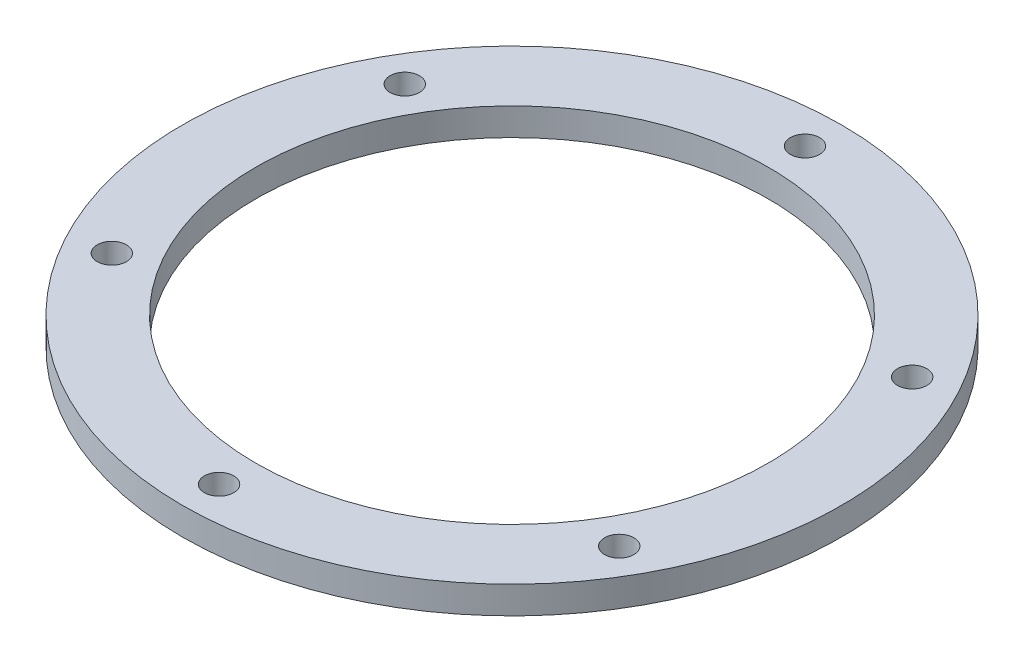
ISO-10303-21;
HEADER;
FILE_DESCRIPTION(('STEP AP214'),'2;1');
FILE_NAME('part.step','',(''),(''),'','','');
FILE_SCHEMA(('AUTOMOTIVE_DESIGN { 1 0 10303 214 1 1 1 1 }'));
ENDSEC;
DATA;
#1=APPLICATION_CONTEXT('core data for automotive mechanical design processes');
#2=APPLICATION_PROTOCOL_DEFINITION('international standard','automotive_design',2000,#1);
#3=PRODUCT_CONTEXT('',#1,'mechanical');
#4=PRODUCT('Part','Part','',(#3));
#5=PRODUCT_RELATED_PRODUCT_CATEGORY('part','',(#4));
#6=PRODUCT_DEFINITION_FORMATION('','',#4);
#7=PRODUCT_DEFINITION_CONTEXT('part definition',#1,'design');
#8=PRODUCT_DEFINITION('design','',#6,#7);
#9=PRODUCT_DEFINITION_SHAPE('','',#8);
#10=(LENGTH_UNIT() NAMED_UNIT(*) SI_UNIT(.MILLI.,.METRE.));
#11=(NAMED_UNIT(*) PLANE_ANGLE_UNIT() SI_UNIT($,.RADIAN.));
#12=(NAMED_UNIT(*) SI_UNIT($,.STERADIAN.) SOLID_ANGLE_UNIT());
#13=UNCERTAINTY_MEASURE_WITH_UNIT(LENGTH_MEASURE(1.E-05),#10,'distance_accuracy_value','');
#14=(GEOMETRIC_REPRESENTATION_CONTEXT(3) GLOBAL_UNCERTAINTY_ASSIGNED_CONTEXT((#13)) GLOBAL_UNIT_ASSIGNED_CONTEXT((#10,
#11,#12)) REPRESENTATION_CONTEXT('',''));
#15=CARTESIAN_POINT('',(0.,0.,0.));
#16=DIRECTION('',(0.,0.,1.));
#17=DIRECTION('',(1.,0.,0.));
#18=AXIS2_PLACEMENT_3D('',#15,#16,#17);
#19=CARTESIAN_POINT('',(0.,3.,0.));
#20=DIRECTION('',(0.,1.,0.));
#21=DIRECTION('',(0.,0.,1.));
#22=AXIS2_PLACEMENT_3D('',#19,#20,#21);
#23=PLANE('',#22);
#24=CARTESIAN_POINT('',(27.7128129211022,3.,-15.9999999999997));
#25=DIRECTION('',(0.,1.,0.));
#26=DIRECTION('',(0.,0.,1.));
#27=AXIS2_PLACEMENT_3D('',#24,#25,#26);
#28=CIRCLE('',#27,1.6);
#29=CARTESIAN_POINT('',(27.7128129211022,3.,-14.3999999999997));
#30=VERTEX_POINT('',#29);
#31=EDGE_CURVE('E100',#30,#30,#28,.T.);
#32=ORIENTED_EDGE('',*,*,#31,.F.);
#33=EDGE_LOOP('',(#32));
#34=FACE_BOUND('',#33,.T.);
#35=CARTESIAN_POINT('',(-27.712812921102,3.,-16.0000000000001));
#36=DIRECTION('',(0.,1.,0.));
#37=DIRECTION('',(0.,0.,1.));
#38=AXIS2_PLACEMENT_3D('',#35,#36,#37);
#39=CIRCLE('',#38,1.6);
#40=CARTESIAN_POINT('',(-27.712812921102,3.,-14.4000000000001));
#41=VERTEX_POINT('',#40);
#42=EDGE_CURVE('E85',#41,#41,#39,.T.);
#43=ORIENTED_EDGE('',*,*,#42,.F.);
#44=EDGE_LOOP('',(#43));
#45=FACE_BOUND('',#44,.T.);
#46=CARTESIAN_POINT('',(-27.7128129211021,3.,15.9999999999999));
#47=DIRECTION('',(0.,1.,0.));
#48=DIRECTION('',(0.,0.,1.));
#49=AXIS2_PLACEMENT_3D('',#46,#47,#48);
#50=CIRCLE('',#49,1.6);
#51=CARTESIAN_POINT('',(-27.7128129211021,3.,17.5999999999999));
#52=VERTEX_POINT('',#51);
#53=EDGE_CURVE('E69',#52,#52,#50,.T.);
#54=ORIENTED_EDGE('',*,*,#53,.F.);
#55=EDGE_LOOP('',(#54));
#56=FACE_BOUND('',#55,.T.);
#57=CARTESIAN_POINT('',(0.,3.,0.));
#58=DIRECTION('',(0.,1.,0.));
#59=DIRECTION('',(0.,0.,1.));
#60=AXIS2_PLACEMENT_3D('',#57,#58,#59);
#61=CIRCLE('',#60,36.);
#62=CARTESIAN_POINT('',(0.,3.,36.));
#63=VERTEX_POINT('',#62);
#64=EDGE_CURVE('E12',#63,#63,#61,.T.);
#65=ORIENTED_EDGE('',*,*,#64,.T.);
#66=EDGE_LOOP('',(#65));
#67=FACE_BOUND('',#66,.T.);
#68=CARTESIAN_POINT('',(0.,3.,32.));
#69=DIRECTION('',(0.,1.,0.));
#70=DIRECTION('',(0.,0.,1.));
#71=AXIS2_PLACEMENT_3D('',#68,#69,#70);
#72=CIRCLE('',#71,1.6);
#73=CARTESIAN_POINT('',(0.,3.,33.6));
#74=VERTEX_POINT('',#73);
#75=EDGE_CURVE('E63',#74,#74,#72,.T.);
#76=ORIENTED_EDGE('',*,*,#75,.F.);
#77=EDGE_LOOP('',(#76));
#78=FACE_BOUND('',#77,.T.);
#79=CARTESIAN_POINT('',(0.,3.,0.));
#80=DIRECTION('',(0.,1.,0.));
#81=DIRECTION('',(0.,0.,1.));
#82=AXIS2_PLACEMENT_3D('',#79,#80,#81);
#83=CIRCLE('',#82,28.);
#84=CARTESIAN_POINT('',(0.,3.,28.));
#85=VERTEX_POINT('',#84);
#86=EDGE_CURVE('E77',#85,#85,#83,.T.);
#87=ORIENTED_EDGE('',*,*,#86,.F.);
#88=EDGE_LOOP('',(#87));
#89=FACE_BOUND('',#88,.T.);
#90=CARTESIAN_POINT('',(2.23454805685961E-13,3.,-32.));
#91=DIRECTION('',(0.,1.,0.));
#92=DIRECTION('',(0.,0.,1.));
#93=AXIS2_PLACEMENT_3D('',#90,#91,#92);
#94=CIRCLE('',#93,1.6);
#95=CARTESIAN_POINT('',(2.23454805685961E-13,3.,-30.4));
#96=VERTEX_POINT('',#95);
#97=EDGE_CURVE('E93',#96,#96,#94,.T.);
#98=ORIENTED_EDGE('',*,*,#97,.F.);
#99=EDGE_LOOP('',(#98));
#100=FACE_BOUND('',#99,.T.);
#101=CARTESIAN_POINT('',(27.7128129211019,3.,16.0000000000003));
#102=DIRECTION('',(0.,1.,0.));
#103=DIRECTION('',(0.,0.,1.));
#104=AXIS2_PLACEMENT_3D('',#101,#102,#103);
#105=CIRCLE('',#104,1.6);
#106=CARTESIAN_POINT('',(27.7128129211019,3.,17.6000000000003));
#107=VERTEX_POINT('',#106);
#108=EDGE_CURVE('E108',#107,#107,#105,.T.);
#109=ORIENTED_EDGE('',*,*,#108,.F.);
#110=EDGE_LOOP('',(#109));
#111=FACE_BOUND('',#110,.T.);
#112=ADVANCED_FACE('F48',(#34,#45,#56,#67,#78,#89,#100,#111),#23,.T.);
#113=CARTESIAN_POINT('',(0.,0.,0.));
#114=DIRECTION('',(0.,1.,0.));
#115=DIRECTION('',(0.,0.,1.));
#116=AXIS2_PLACEMENT_3D('',#113,#114,#115);
#117=PLANE('',#116);
#118=CARTESIAN_POINT('',(0.,0.,0.));
#119=DIRECTION('',(0.,1.,0.));
#120=DIRECTION('',(0.,0.,1.));
#121=AXIS2_PLACEMENT_3D('',#118,#119,#120);
#122=CIRCLE('',#121,36.);
#123=CARTESIAN_POINT('',(0.,0.,36.));
#124=VERTEX_POINT('',#123);
#125=EDGE_CURVE('E52',#124,#124,#122,.T.);
#126=ORIENTED_EDGE('',*,*,#125,.F.);
#127=EDGE_LOOP('',(#126));
#128=FACE_BOUND('',#127,.T.);
#129=CARTESIAN_POINT('',(0.,0.,32.));
#130=DIRECTION('',(0.,1.,0.));
#131=DIRECTION('',(0.,0.,1.));
#132=AXIS2_PLACEMENT_3D('',#129,#130,#131);
#133=CIRCLE('',#132,1.6);
#134=CARTESIAN_POINT('',(0.,0.,33.6));
#135=VERTEX_POINT('',#134);
#136=EDGE_CURVE('E65',#135,#135,#133,.T.);
#137=ORIENTED_EDGE('',*,*,#136,.T.);
#138=EDGE_LOOP('',(#137));
#139=FACE_BOUND('',#138,.T.);
#140=CARTESIAN_POINT('',(-27.7128129211021,0.,15.9999999999999));
#141=DIRECTION('',(0.,1.,0.));
#142=DIRECTION('',(0.,0.,1.));
#143=AXIS2_PLACEMENT_3D('',#140,#141,#142);
#144=CIRCLE('',#143,1.6);
#145=CARTESIAN_POINT('',(-27.7128129211021,0.,17.5999999999999));
#146=VERTEX_POINT('',#145);
#147=EDGE_CURVE('E73',#146,#146,#144,.T.);
#148=ORIENTED_EDGE('',*,*,#147,.T.);
#149=EDGE_LOOP('',(#148));
#150=FACE_BOUND('',#149,.T.);
#151=CARTESIAN_POINT('',(0.,0.,0.));
#152=DIRECTION('',(0.,1.,0.));
#153=DIRECTION('',(0.,0.,1.));
#154=AXIS2_PLACEMENT_3D('',#151,#152,#153);
#155=CIRCLE('',#154,28.);
#156=CARTESIAN_POINT('',(0.,0.,28.));
#157=VERTEX_POINT('',#156);
#158=EDGE_CURVE('E81',#157,#157,#155,.T.);
#159=ORIENTED_EDGE('',*,*,#158,.T.);
#160=EDGE_LOOP('',(#159));
#161=FACE_BOUND('',#160,.T.);
#162=CARTESIAN_POINT('',(-27.712812921102,0.,-16.0000000000001));
#163=DIRECTION('',(0.,1.,0.));
#164=DIRECTION('',(0.,0.,1.));
#165=AXIS2_PLACEMENT_3D('',#162,#163,#164);
#166=CIRCLE('',#165,1.6);
#167=CARTESIAN_POINT('',(-27.712812921102,0.,-14.4000000000001));
#168=VERTEX_POINT('',#167);
#169=EDGE_CURVE('E89',#168,#168,#166,.T.);
#170=ORIENTED_EDGE('',*,*,#169,.T.);
#171=EDGE_LOOP('',(#170));
#172=FACE_BOUND('',#171,.T.);
#173=CARTESIAN_POINT('',(2.23454805685961E-13,0.,-32.));
#174=DIRECTION('',(0.,1.,0.));
#175=DIRECTION('',(0.,0.,1.));
#176=AXIS2_PLACEMENT_3D('',#173,#174,#175);
#177=CIRCLE('',#176,1.6);
#178=CARTESIAN_POINT('',(2.23454805685961E-13,0.,-30.4));
#179=VERTEX_POINT('',#178);
#180=EDGE_CURVE('E96',#179,#179,#177,.T.);
#181=ORIENTED_EDGE('',*,*,#180,.T.);
#182=EDGE_LOOP('',(#181));
#183=FACE_BOUND('',#182,.T.);
#184=CARTESIAN_POINT('',(27.7128129211022,0.,-15.9999999999997));
#185=DIRECTION('',(0.,1.,0.));
#186=DIRECTION('',(0.,0.,1.));
#187=AXIS2_PLACEMENT_3D('',#184,#185,#186);
#188=CIRCLE('',#187,1.6);
#189=CARTESIAN_POINT('',(27.7128129211022,0.,-14.3999999999997));
#190=VERTEX_POINT('',#189);
#191=EDGE_CURVE('E104',#190,#190,#188,.T.);
#192=ORIENTED_EDGE('',*,*,#191,.T.);
#193=EDGE_LOOP('',(#192));
#194=FACE_BOUND('',#193,.T.);
#195=CARTESIAN_POINT('',(27.7128129211019,0.,16.0000000000003));
#196=DIRECTION('',(0.,1.,0.));
#197=DIRECTION('',(0.,0.,1.));
#198=AXIS2_PLACEMENT_3D('',#195,#196,#197);
#199=CIRCLE('',#198,1.6);
#200=CARTESIAN_POINT('',(27.7128129211019,0.,17.6000000000003));
#201=VERTEX_POINT('',#200);
#202=EDGE_CURVE('E112',#201,#201,#199,.T.);
#203=ORIENTED_EDGE('',*,*,#202,.T.);
#204=EDGE_LOOP('',(#203));
#205=FACE_BOUND('',#204,.T.);
#206=ADVANCED_FACE('F127',(#128,#139,#150,#161,#172,#183,#194,#205),#117,.F.);
#207=CARTESIAN_POINT('',(0.,3.,0.));
#208=DIRECTION('',(0.,-1.,0.));
#209=DIRECTION('',(0.,0.,-1.));
#210=AXIS2_PLACEMENT_3D('',#207,#208,#209);
#211=CYLINDRICAL_SURFACE('',#210,36.);
#212=ORIENTED_EDGE('',*,*,#64,.F.);
#213=EDGE_LOOP('',(#212));
#214=FACE_BOUND('',#213,.T.);
#215=ORIENTED_EDGE('',*,*,#125,.T.);
#216=EDGE_LOOP('',(#215));
#217=FACE_BOUND('',#216,.T.);
#218=ADVANCED_FACE('F50',(#214,#217),#211,.T.);
#219=CARTESIAN_POINT('',(0.,3.,32.));
#220=DIRECTION('',(0.,-1.,0.));
#221=DIRECTION('',(0.,0.,-1.));
#222=AXIS2_PLACEMENT_3D('',#219,#220,#221);
#223=CYLINDRICAL_SURFACE('',#222,1.6);
#224=ORIENTED_EDGE('',*,*,#75,.T.);
#225=EDGE_LOOP('',(#224));
#226=FACE_BOUND('',#225,.T.);
#227=ORIENTED_EDGE('',*,*,#136,.F.);
#228=EDGE_LOOP('',(#227));
#229=FACE_BOUND('',#228,.T.);
#230=ADVANCED_FACE('F137',(#226,#229),#223,.F.);
#231=CARTESIAN_POINT('',(-27.7128129211021,3.,15.9999999999999));
#232=DIRECTION('',(0.,-1.,0.));
#233=DIRECTION('',(0.,0.,-1.));
#234=AXIS2_PLACEMENT_3D('',#231,#232,#233);
#235=CYLINDRICAL_SURFACE('',#234,1.6);
#236=ORIENTED_EDGE('',*,*,#53,.T.);
#237=EDGE_LOOP('',(#236));
#238=FACE_BOUND('',#237,.T.);
#239=ORIENTED_EDGE('',*,*,#147,.F.);
#240=EDGE_LOOP('',(#239));
#241=FACE_BOUND('',#240,.T.);
#242=ADVANCED_FACE('F140',(#238,#241),#235,.F.);
#243=CARTESIAN_POINT('',(0.,3.,0.));
#244=DIRECTION('',(0.,-1.,0.));
#245=DIRECTION('',(0.,0.,-1.));
#246=AXIS2_PLACEMENT_3D('',#243,#244,#245);
#247=CYLINDRICAL_SURFACE('',#246,28.);
#248=ORIENTED_EDGE('',*,*,#86,.T.);
#249=EDGE_LOOP('',(#248));
#250=FACE_BOUND('',#249,.T.);
#251=ORIENTED_EDGE('',*,*,#158,.F.);
#252=EDGE_LOOP('',(#251));
#253=FACE_BOUND('',#252,.T.);
#254=ADVANCED_FACE('F144',(#250,#253),#247,.F.);
#255=CARTESIAN_POINT('',(-27.712812921102,3.,-16.0000000000001));
#256=DIRECTION('',(0.,-1.,0.));
#257=DIRECTION('',(0.,0.,-1.));
#258=AXIS2_PLACEMENT_3D('',#255,#256,#257);
#259=CYLINDRICAL_SURFACE('',#258,1.6);
#260=ORIENTED_EDGE('',*,*,#42,.T.);
#261=EDGE_LOOP('',(#260));
#262=FACE_BOUND('',#261,.T.);
#263=ORIENTED_EDGE('',*,*,#169,.F.);
#264=EDGE_LOOP('',(#263));
#265=FACE_BOUND('',#264,.T.);
#266=ADVANCED_FACE('F148',(#262,#265),#259,.F.);
#267=CARTESIAN_POINT('',(2.23454805685961E-13,3.,-32.));
#268=DIRECTION('',(0.,-1.,0.));
#269=DIRECTION('',(0.,0.,-1.));
#270=AXIS2_PLACEMENT_3D('',#267,#268,#269);
#271=CYLINDRICAL_SURFACE('',#270,1.6);
#272=ORIENTED_EDGE('',*,*,#97,.T.);
#273=EDGE_LOOP('',(#272));
#274=FACE_BOUND('',#273,.T.);
#275=ORIENTED_EDGE('',*,*,#180,.F.);
#276=EDGE_LOOP('',(#275));
#277=FACE_BOUND('',#276,.T.);
#278=ADVANCED_FACE('F152',(#274,#277),#271,.F.);
#279=CARTESIAN_POINT('',(27.7128129211022,3.,-15.9999999999997));
#280=DIRECTION('',(0.,-1.,0.));
#281=DIRECTION('',(0.,0.,-1.));
#282=AXIS2_PLACEMENT_3D('',#279,#280,#281);
#283=CYLINDRICAL_SURFACE('',#282,1.6);
#284=ORIENTED_EDGE('',*,*,#31,.T.);
#285=EDGE_LOOP('',(#284));
#286=FACE_BOUND('',#285,.T.);
#287=ORIENTED_EDGE('',*,*,#191,.F.);
#288=EDGE_LOOP('',(#287));
#289=FACE_BOUND('',#288,.T.);
#290=ADVANCED_FACE('F156',(#286,#289),#283,.F.);
#291=CARTESIAN_POINT('',(27.7128129211019,3.,16.0000000000003));
#292=DIRECTION('',(0.,-1.,0.));
#293=DIRECTION('',(0.,0.,-1.));
#294=AXIS2_PLACEMENT_3D('',#291,#292,#293);
#295=CYLINDRICAL_SURFACE('',#294,1.6);
#296=ORIENTED_EDGE('',*,*,#108,.T.);
#297=EDGE_LOOP('',(#296));
#298=FACE_BOUND('',#297,.T.);
#299=ORIENTED_EDGE('',*,*,#202,.F.);
#300=EDGE_LOOP('',(#299));
#301=FACE_BOUND('',#300,.T.);
#302=ADVANCED_FACE('F123',(#298,#301),#295,.F.);
#303=CLOSED_SHELL('',(#112,#206,#218,#230,#242,#254,#266,#278,#290,#302));
#304=MANIFOLD_SOLID_BREP('B2',#303);
#305=ADVANCED_BREP_SHAPE_REPRESENTATION('',(#18,#304),#14);
#306=SHAPE_DEFINITION_REPRESENTATION(#9,#305);
ENDSEC;
END-ISO-10303-21;
